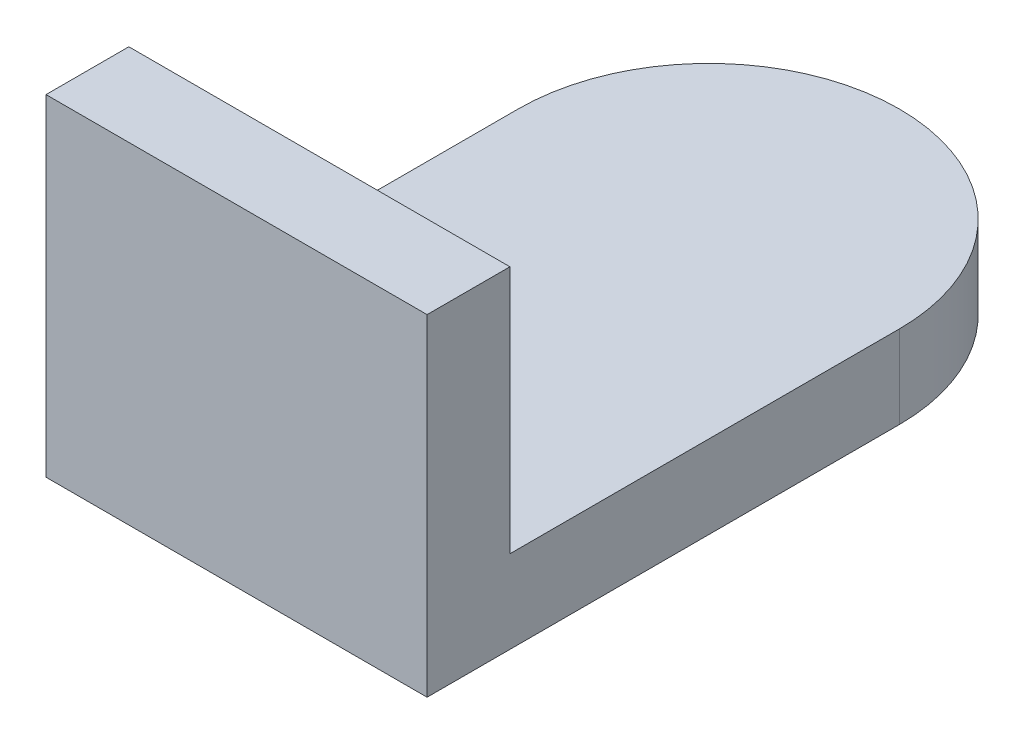
ISO-10303-21;
HEADER;
FILE_DESCRIPTION(('STEP AP214'),'2;1');
FILE_NAME('part.step','',(''),(''),'','','');
FILE_SCHEMA(('AUTOMOTIVE_DESIGN { 1 0 10303 214 1 1 1 1 }'));
ENDSEC;
DATA;
#1=APPLICATION_CONTEXT('core data for automotive mechanical design processes');
#2=APPLICATION_PROTOCOL_DEFINITION('international standard','automotive_design',2000,#1);
#3=PRODUCT_CONTEXT('',#1,'mechanical');
#4=PRODUCT('Part','Part','',(#3));
#5=PRODUCT_RELATED_PRODUCT_CATEGORY('part','',(#4));
#6=PRODUCT_DEFINITION_FORMATION('','',#4);
#7=PRODUCT_DEFINITION_CONTEXT('part definition',#1,'design');
#8=PRODUCT_DEFINITION('design','',#6,#7);
#9=PRODUCT_DEFINITION_SHAPE('','',#8);
#10=(LENGTH_UNIT() NAMED_UNIT(*) SI_UNIT(.MILLI.,.METRE.));
#11=(NAMED_UNIT(*) PLANE_ANGLE_UNIT() SI_UNIT($,.RADIAN.));
#12=(NAMED_UNIT(*) SI_UNIT($,.STERADIAN.) SOLID_ANGLE_UNIT());
#13=UNCERTAINTY_MEASURE_WITH_UNIT(LENGTH_MEASURE(1.E-05),#10,'distance_accuracy_value','');
#14=(GEOMETRIC_REPRESENTATION_CONTEXT(3) GLOBAL_UNCERTAINTY_ASSIGNED_CONTEXT((#13)) GLOBAL_UNIT_ASSIGNED_CONTEXT((#10,
#11,#12)) REPRESENTATION_CONTEXT('',''));
#15=CARTESIAN_POINT('',(0.,0.,0.));
#16=DIRECTION('',(0.,0.,1.));
#17=DIRECTION('',(1.,0.,0.));
#18=AXIS2_PLACEMENT_3D('',#15,#16,#17);
#19=CARTESIAN_POINT('',(-0.865,-0.2,1.45));
#20=DIRECTION('',(-1.,0.,0.));
#21=DIRECTION('',(0.,0.,1.));
#22=AXIS2_PLACEMENT_3D('',#19,#20,#21);
#23=PLANE('',#22);
#24=DIRECTION('',(0.,-1.,0.));
#25=VECTOR('',#24,1.);
#26=CARTESIAN_POINT('',(-0.865,-0.2,1.5));
#27=LINE('',#26,#25);
#28=CARTESIAN_POINT('',(-0.865,-0.2,1.5));
#29=VERTEX_POINT('',#28);
#30=CARTESIAN_POINT('',(-0.865,-0.4,1.5));
#31=VERTEX_POINT('',#30);
#32=EDGE_CURVE('E11',#29,#31,#27,.T.);
#33=ORIENTED_EDGE('',*,*,#32,.F.);
#34=DIRECTION('',(0.,0.,1.));
#35=VECTOR('',#34,1.);
#36=CARTESIAN_POINT('',(-0.865,-0.2,1.45));
#37=LINE('',#36,#35);
#38=CARTESIAN_POINT('',(-0.865,-0.2,1.45));
#39=VERTEX_POINT('',#38);
#40=EDGE_CURVE('E24',#39,#29,#37,.T.);
#41=ORIENTED_EDGE('',*,*,#40,.F.);
#42=DIRECTION('',(0.,-1.,0.));
#43=VECTOR('',#42,1.);
#44=CARTESIAN_POINT('',(-0.865,-0.2,1.45));
#45=LINE('',#44,#43);
#46=CARTESIAN_POINT('',(-0.865,-0.35,1.45));
#47=VERTEX_POINT('',#46);
#48=EDGE_CURVE('E116',#39,#47,#45,.T.);
#49=ORIENTED_EDGE('',*,*,#48,.T.);
#50=DIRECTION('',(0.,0.,-1.));
#51=VECTOR('',#50,1.);
#52=CARTESIAN_POINT('',(-0.865,-0.35,1.45));
#53=LINE('',#52,#51);
#54=CARTESIAN_POINT('',(-0.865,-0.35,1.215));
#55=VERTEX_POINT('',#54);
#56=EDGE_CURVE('E90',#47,#55,#53,.T.);
#57=ORIENTED_EDGE('',*,*,#56,.T.);
#58=DIRECTION('',(0.,-1.,0.));
#59=VECTOR('',#58,1.);
#60=CARTESIAN_POINT('',(-0.865,-0.35,1.215));
#61=LINE('',#60,#59);
#62=CARTESIAN_POINT('',(-0.865,-0.4,1.215));
#63=VERTEX_POINT('',#62);
#64=EDGE_CURVE('E113',#55,#63,#61,.T.);
#65=ORIENTED_EDGE('',*,*,#64,.T.);
#66=DIRECTION('',(0.,0.,1.));
#67=VECTOR('',#66,1.);
#68=CARTESIAN_POINT('',(-0.865,-0.4,1.45));
#69=LINE('',#68,#67);
#70=EDGE_CURVE('E111',#63,#31,#69,.T.);
#71=ORIENTED_EDGE('',*,*,#70,.T.);
#72=EDGE_LOOP('',(#33,#41,#49,#57,#65,#71));
#73=FACE_BOUND('',#72,.T.);
#74=ADVANCED_FACE('F17',(#73),#23,.T.);
#75=CARTESIAN_POINT('',(-0.865,-0.2,1.45));
#76=DIRECTION('',(0.,1.,0.));
#77=DIRECTION('',(-1.,0.,0.));
#78=AXIS2_PLACEMENT_3D('',#75,#76,#77);
#79=PLANE('',#78);
#80=DIRECTION('',(-1.,0.,0.));
#81=VECTOR('',#80,1.);
#82=CARTESIAN_POINT('',(-0.865,-0.2,1.5));
#83=LINE('',#82,#81);
#84=CARTESIAN_POINT('',(-0.635,-0.2,1.5));
#85=VERTEX_POINT('',#84);
#86=EDGE_CURVE('E109',#85,#29,#83,.T.);
#87=ORIENTED_EDGE('',*,*,#86,.F.);
#88=DIRECTION('',(0.,0.,1.));
#89=VECTOR('',#88,1.);
#90=CARTESIAN_POINT('',(-0.635,-0.2,1.45));
#91=LINE('',#90,#89);
#92=CARTESIAN_POINT('',(-0.635,-0.2,1.45));
#93=VERTEX_POINT('',#92);
#94=EDGE_CURVE('E107',#93,#85,#91,.T.);
#95=ORIENTED_EDGE('',*,*,#94,.F.);
#96=DIRECTION('',(-1.,0.,0.));
#97=VECTOR('',#96,1.);
#98=CARTESIAN_POINT('',(-0.865,-0.2,1.45));
#99=LINE('',#98,#97);
#100=EDGE_CURVE('E85',#93,#39,#99,.T.);
#101=ORIENTED_EDGE('',*,*,#100,.T.);
#102=ORIENTED_EDGE('',*,*,#40,.T.);
#103=EDGE_LOOP('',(#87,#95,#101,#102));
#104=FACE_BOUND('',#103,.T.);
#105=ADVANCED_FACE('F118',(#104),#79,.T.);
#106=CARTESIAN_POINT('',(-0.635,-0.2,1.45));
#107=DIRECTION('',(1.,0.,0.));
#108=DIRECTION('',(0.,0.,-1.));
#109=AXIS2_PLACEMENT_3D('',#106,#107,#108);
#110=PLANE('',#109);
#111=DIRECTION('',(0.,1.,0.));
#112=VECTOR('',#111,1.);
#113=CARTESIAN_POINT('',(-0.635,-0.2,1.5));
#114=LINE('',#113,#112);
#115=CARTESIAN_POINT('',(-0.635,-0.4,1.5));
#116=VERTEX_POINT('',#115);
#117=EDGE_CURVE('E103',#116,#85,#114,.T.);
#118=ORIENTED_EDGE('',*,*,#117,.F.);
#119=DIRECTION('',(0.,0.,1.));
#120=VECTOR('',#119,1.);
#121=CARTESIAN_POINT('',(-0.635,-0.4,1.45));
#122=LINE('',#121,#120);
#123=CARTESIAN_POINT('',(-0.635,-0.4,1.215));
#124=VERTEX_POINT('',#123);
#125=EDGE_CURVE('E100',#124,#116,#122,.T.);
#126=ORIENTED_EDGE('',*,*,#125,.F.);
#127=DIRECTION('',(0.,-1.,0.));
#128=VECTOR('',#127,1.);
#129=CARTESIAN_POINT('',(-0.635,-0.35,1.215));
#130=LINE('',#129,#128);
#131=CARTESIAN_POINT('',(-0.635,-0.35,1.215));
#132=VERTEX_POINT('',#131);
#133=EDGE_CURVE('E72',#132,#124,#130,.T.);
#134=ORIENTED_EDGE('',*,*,#133,.F.);
#135=DIRECTION('',(0.,0.,1.));
#136=VECTOR('',#135,1.);
#137=CARTESIAN_POINT('',(-0.635,-0.35,1.45));
#138=LINE('',#137,#136);
#139=CARTESIAN_POINT('',(-0.635,-0.35,1.45));
#140=VERTEX_POINT('',#139);
#141=EDGE_CURVE('E66',#132,#140,#138,.T.);
#142=ORIENTED_EDGE('',*,*,#141,.T.);
#143=DIRECTION('',(0.,1.,0.));
#144=VECTOR('',#143,1.);
#145=CARTESIAN_POINT('',(-0.635,-0.2,1.45));
#146=LINE('',#145,#144);
#147=EDGE_CURVE('E70',#140,#93,#146,.T.);
#148=ORIENTED_EDGE('',*,*,#147,.T.);
#149=ORIENTED_EDGE('',*,*,#94,.T.);
#150=EDGE_LOOP('',(#118,#126,#134,#142,#148,#149));
#151=FACE_BOUND('',#150,.T.);
#152=ADVANCED_FACE('F68',(#151),#110,.T.);
#153=CARTESIAN_POINT('',(-0.865,-0.4,1.45));
#154=DIRECTION('',(0.,-1.,0.));
#155=DIRECTION('',(1.,0.,0.));
#156=AXIS2_PLACEMENT_3D('',#153,#154,#155);
#157=PLANE('',#156);
#158=DIRECTION('',(1.,0.,0.));
#159=VECTOR('',#158,1.);
#160=CARTESIAN_POINT('',(-0.865,-0.4,1.5));
#161=LINE('',#160,#159);
#162=EDGE_CURVE('E86',#31,#116,#161,.T.);
#163=ORIENTED_EDGE('',*,*,#162,.F.);
#164=ORIENTED_EDGE('',*,*,#70,.F.);
#165=CARTESIAN_POINT('',(-0.75,-0.4,1.215));
#166=DIRECTION('',(0.,-1.,0.));
#167=DIRECTION('',(1.,0.,0.));
#168=AXIS2_PLACEMENT_3D('',#165,#166,#167);
#169=CIRCLE('',#168,0.115);
#170=EDGE_CURVE('E91',#63,#124,#169,.T.);
#171=ORIENTED_EDGE('',*,*,#170,.T.);
#172=ORIENTED_EDGE('',*,*,#125,.T.);
#173=EDGE_LOOP('',(#163,#164,#171,#172));
#174=FACE_BOUND('',#173,.T.);
#175=ADVANCED_FACE('F122',(#174),#157,.T.);
#176=CARTESIAN_POINT('',(0.,0.,1.45));
#177=DIRECTION('',(0.,0.,1.));
#178=DIRECTION('',(1.,0.,0.));
#179=AXIS2_PLACEMENT_3D('',#176,#177,#178);
#180=PLANE('',#179);
#181=ORIENTED_EDGE('',*,*,#147,.F.);
#182=DIRECTION('',(-1.,0.,0.));
#183=VECTOR('',#182,1.);
#184=CARTESIAN_POINT('',(-0.865,-0.35,1.45));
#185=LINE('',#184,#183);
#186=EDGE_CURVE('E83',#140,#47,#185,.T.);
#187=ORIENTED_EDGE('',*,*,#186,.T.);
#188=ORIENTED_EDGE('',*,*,#48,.F.);
#189=ORIENTED_EDGE('',*,*,#100,.F.);
#190=EDGE_LOOP('',(#181,#187,#188,#189));
#191=FACE_BOUND('',#190,.T.);
#192=ADVANCED_FACE('F81',(#191),#180,.F.);
#193=CARTESIAN_POINT('',(0.,0.,1.5));
#194=DIRECTION('',(0.,0.,1.));
#195=DIRECTION('',(1.,0.,0.));
#196=AXIS2_PLACEMENT_3D('',#193,#194,#195);
#197=PLANE('',#196);
#198=ORIENTED_EDGE('',*,*,#32,.T.);
#199=ORIENTED_EDGE('',*,*,#162,.T.);
#200=ORIENTED_EDGE('',*,*,#117,.T.);
#201=ORIENTED_EDGE('',*,*,#86,.T.);
#202=EDGE_LOOP('',(#198,#199,#200,#201));
#203=FACE_BOUND('',#202,.T.);
#204=ADVANCED_FACE('F119',(#203),#197,.T.);
#205=CARTESIAN_POINT('',(-0.75,-0.35,1.215));
#206=DIRECTION('',(0.,-1.,0.));
#207=DIRECTION('',(1.,0.,0.));
#208=AXIS2_PLACEMENT_3D('',#205,#206,#207);
#209=CYLINDRICAL_SURFACE('',#208,0.115);
#210=ORIENTED_EDGE('',*,*,#170,.F.);
#211=ORIENTED_EDGE('',*,*,#64,.F.);
#212=CARTESIAN_POINT('',(-0.75,-0.35,1.215));
#213=DIRECTION('',(0.,-1.,0.));
#214=DIRECTION('',(1.,0.,0.));
#215=AXIS2_PLACEMENT_3D('',#212,#213,#214);
#216=CIRCLE('',#215,0.115);
#217=EDGE_CURVE('E92',#55,#132,#216,.T.);
#218=ORIENTED_EDGE('',*,*,#217,.T.);
#219=ORIENTED_EDGE('',*,*,#133,.T.);
#220=EDGE_LOOP('',(#210,#211,#218,#219));
#221=FACE_BOUND('',#220,.T.);
#222=ADVANCED_FACE('F127',(#221),#209,.T.);
#223=CARTESIAN_POINT('',(-0.75,-0.35,1.215));
#224=DIRECTION('',(0.,-1.,0.));
#225=DIRECTION('',(1.,0.,0.));
#226=AXIS2_PLACEMENT_3D('',#223,#224,#225);
#227=PLANE('',#226);
#228=ORIENTED_EDGE('',*,*,#56,.F.);
#229=ORIENTED_EDGE('',*,*,#186,.F.);
#230=ORIENTED_EDGE('',*,*,#141,.F.);
#231=ORIENTED_EDGE('',*,*,#217,.F.);
#232=EDGE_LOOP('',(#228,#229,#230,#231));
#233=FACE_BOUND('',#232,.T.);
#234=ADVANCED_FACE('F89',(#233),#227,.F.);
#235=CLOSED_SHELL('',(#74,#105,#152,#175,#192,#204,#222,#234));
#236=MANIFOLD_SOLID_BREP('B1',#235);
#237=ADVANCED_BREP_SHAPE_REPRESENTATION('',(#18,#236),#14);
#238=SHAPE_DEFINITION_REPRESENTATION(#9,#237);
ENDSEC;
END-ISO-10303-21;
